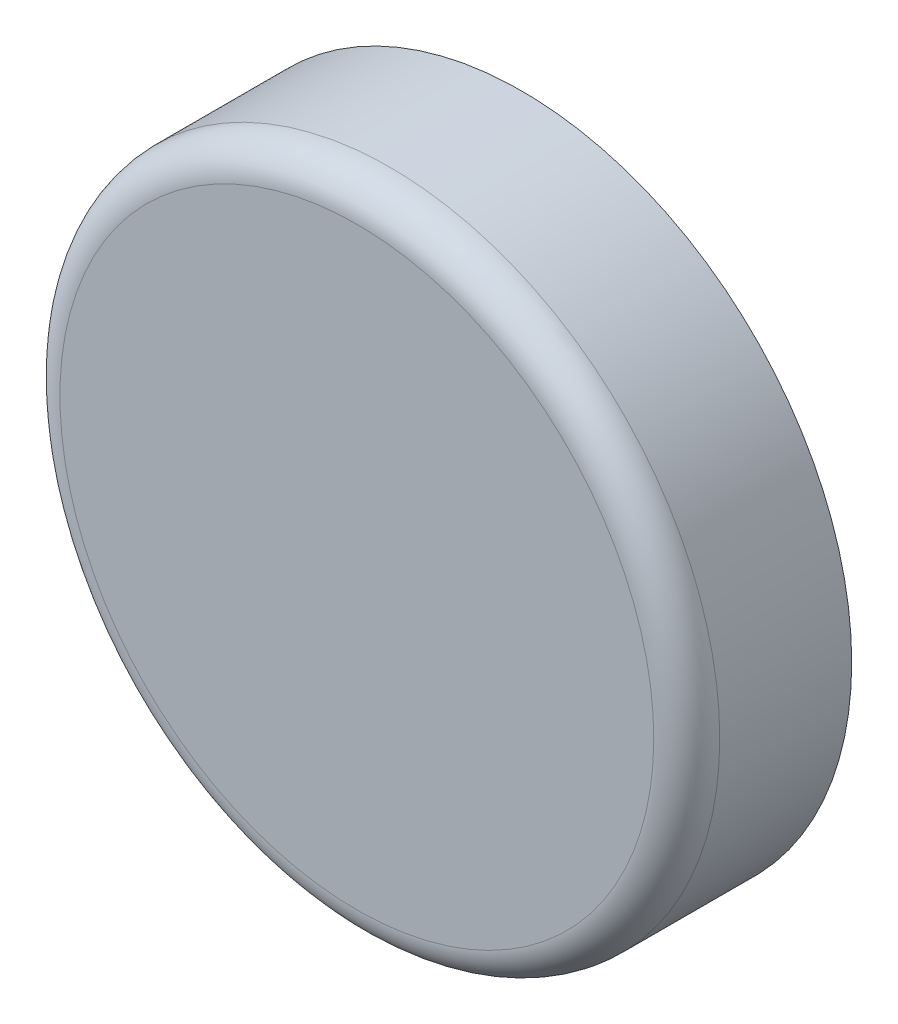
ISO-10303-21;
HEADER;
FILE_DESCRIPTION(('STEP AP214'),'2;1');
FILE_NAME('part.step','',(''),(''),'','','');
FILE_SCHEMA(('AUTOMOTIVE_DESIGN { 1 0 10303 214 1 1 1 1 }'));
ENDSEC;
DATA;
#1=APPLICATION_CONTEXT('core data for automotive mechanical design processes');
#2=APPLICATION_PROTOCOL_DEFINITION('international standard','automotive_design',2000,#1);
#3=PRODUCT_CONTEXT('',#1,'mechanical');
#4=PRODUCT('Part','Part','',(#3));
#5=PRODUCT_RELATED_PRODUCT_CATEGORY('part','',(#4));
#6=PRODUCT_DEFINITION_FORMATION('','',#4);
#7=PRODUCT_DEFINITION_CONTEXT('part definition',#1,'design');
#8=PRODUCT_DEFINITION('design','',#6,#7);
#9=PRODUCT_DEFINITION_SHAPE('','',#8);
#10=(LENGTH_UNIT() NAMED_UNIT(*) SI_UNIT(.MILLI.,.METRE.));
#11=(NAMED_UNIT(*) PLANE_ANGLE_UNIT() SI_UNIT($,.RADIAN.));
#12=(NAMED_UNIT(*) SI_UNIT($,.STERADIAN.) SOLID_ANGLE_UNIT());
#13=UNCERTAINTY_MEASURE_WITH_UNIT(LENGTH_MEASURE(1.E-05),#10,'distance_accuracy_value','');
#14=(GEOMETRIC_REPRESENTATION_CONTEXT(3) GLOBAL_UNCERTAINTY_ASSIGNED_CONTEXT((#13)) GLOBAL_UNIT_ASSIGNED_CONTEXT((#10,
#11,#12)) REPRESENTATION_CONTEXT('',''));
#15=CARTESIAN_POINT('',(0.,0.,0.));
#16=DIRECTION('',(0.,0.,1.));
#17=DIRECTION('',(1.,0.,0.));
#18=AXIS2_PLACEMENT_3D('',#15,#16,#17);
#19=CARTESIAN_POINT('',(-11.2277487707048,10.6772112687117,5.));
#20=DIRECTION('',(0.,0.,-1.));
#21=DIRECTION('',(-1.,0.,0.));
#22=AXIS2_PLACEMENT_3D('',#19,#20,#21);
#23=CYLINDRICAL_SURFACE('',#22,10.);
#24=CARTESIAN_POINT('',(-11.2277487707048,10.6772112687117,4.));
#25=DIRECTION('',(0.,0.,1.));
#26=DIRECTION('',(1.,0.,0.));
#27=AXIS2_PLACEMENT_3D('',#24,#25,#26);
#28=CIRCLE('',#27,10.);
#29=CARTESIAN_POINT('',(-1.22774877070477,10.6772112687117,4.));
#30=VERTEX_POINT('',#29);
#31=EDGE_CURVE('E10',#30,#30,#28,.F.);
#32=ORIENTED_EDGE('',*,*,#31,.T.);
#33=EDGE_LOOP('',(#32));
#34=FACE_BOUND('',#33,.T.);
#35=CARTESIAN_POINT('',(-11.2277487707048,10.6772112687117,0.));
#36=DIRECTION('',(0.,0.,1.));
#37=DIRECTION('',(1.,0.,0.));
#38=AXIS2_PLACEMENT_3D('',#35,#36,#37);
#39=CIRCLE('',#38,10.);
#40=CARTESIAN_POINT('',(-1.22774877070477,10.6772112687117,0.));
#41=VERTEX_POINT('',#40);
#42=EDGE_CURVE('E43',#41,#41,#39,.T.);
#43=ORIENTED_EDGE('',*,*,#42,.T.);
#44=EDGE_LOOP('',(#43));
#45=FACE_BOUND('',#44,.T.);
#46=ADVANCED_FACE('F32',(#34,#45),#23,.T.);
#47=CARTESIAN_POINT('',(-11.2277487707048,10.6772112687117,5.));
#48=DIRECTION('',(0.,0.,1.));
#49=DIRECTION('',(1.,0.,0.));
#50=AXIS2_PLACEMENT_3D('',#47,#48,#49);
#51=PLANE('',#50);
#52=CARTESIAN_POINT('',(-11.2277487707048,10.6772112687117,5.));
#53=DIRECTION('',(0.,0.,1.));
#54=DIRECTION('',(1.,0.,0.));
#55=AXIS2_PLACEMENT_3D('',#52,#53,#54);
#56=CIRCLE('',#55,9.);
#57=CARTESIAN_POINT('',(-2.22774877070477,10.6772112687117,5.));
#58=VERTEX_POINT('',#57);
#59=EDGE_CURVE('E39',#58,#58,#56,.T.);
#60=ORIENTED_EDGE('',*,*,#59,.T.);
#61=EDGE_LOOP('',(#60));
#62=FACE_BOUND('',#61,.T.);
#63=ADVANCED_FACE('F53',(#62),#51,.T.);
#64=CARTESIAN_POINT('',(-11.2277487707048,10.6772112687117,0.));
#65=DIRECTION('',(0.,0.,1.));
#66=DIRECTION('',(1.,0.,0.));
#67=AXIS2_PLACEMENT_3D('',#64,#65,#66);
#68=PLANE('',#67);
#69=ORIENTED_EDGE('',*,*,#42,.F.);
#70=EDGE_LOOP('',(#69));
#71=FACE_BOUND('',#70,.T.);
#72=ADVANCED_FACE('F51',(#71),#68,.F.);
#73=CARTESIAN_POINT('',(-11.2277487707048,10.6772112687117,4.));
#74=DIRECTION('',(0.,0.,1.));
#75=DIRECTION('',(1.,0.,0.));
#76=AXIS2_PLACEMENT_3D('',#73,#74,#75);
#77=TOROIDAL_SURFACE('',#76,9.,1.);
#78=ORIENTED_EDGE('',*,*,#31,.F.);
#79=EDGE_LOOP('',(#78));
#80=FACE_BOUND('',#79,.T.);
#81=ORIENTED_EDGE('',*,*,#59,.F.);
#82=EDGE_LOOP('',(#81));
#83=FACE_BOUND('',#82,.T.);
#84=ADVANCED_FACE('F34',(#80,#83),#77,.T.);
#85=CLOSED_SHELL('',(#46,#63,#72,#84));
#86=MANIFOLD_SOLID_BREP('B2',#85);
#87=ADVANCED_BREP_SHAPE_REPRESENTATION('',(#18,#86),#14);
#88=SHAPE_DEFINITION_REPRESENTATION(#9,#87);
ENDSEC;
END-ISO-10303-21;
